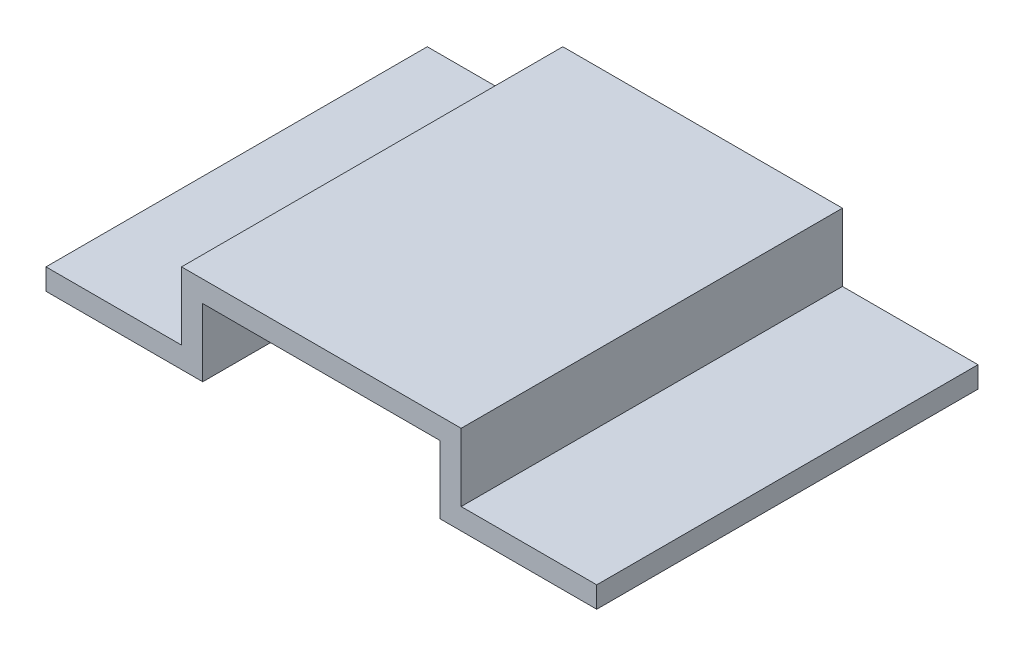
ISO-10303-21;
HEADER;
FILE_DESCRIPTION(('STEP AP214'),'2;1');
FILE_NAME('part.step','',(''),(''),'','','');
FILE_SCHEMA(('AUTOMOTIVE_DESIGN { 1 0 10303 214 1 1 1 1 }'));
ENDSEC;
DATA;
#1=APPLICATION_CONTEXT('core data for automotive mechanical design processes');
#2=APPLICATION_PROTOCOL_DEFINITION('international standard','automotive_design',2000,#1);
#3=PRODUCT_CONTEXT('',#1,'mechanical');
#4=PRODUCT('Part','Part','',(#3));
#5=PRODUCT_RELATED_PRODUCT_CATEGORY('part','',(#4));
#6=PRODUCT_DEFINITION_FORMATION('','',#4);
#7=PRODUCT_DEFINITION_CONTEXT('part definition',#1,'design');
#8=PRODUCT_DEFINITION('design','',#6,#7);
#9=PRODUCT_DEFINITION_SHAPE('','',#8);
#10=(LENGTH_UNIT() NAMED_UNIT(*) SI_UNIT(.MILLI.,.METRE.));
#11=(NAMED_UNIT(*) PLANE_ANGLE_UNIT() SI_UNIT($,.RADIAN.));
#12=(NAMED_UNIT(*) SI_UNIT($,.STERADIAN.) SOLID_ANGLE_UNIT());
#13=UNCERTAINTY_MEASURE_WITH_UNIT(LENGTH_MEASURE(1.E-05),#10,'distance_accuracy_value','');
#14=(GEOMETRIC_REPRESENTATION_CONTEXT(3) GLOBAL_UNCERTAINTY_ASSIGNED_CONTEXT((#13)) GLOBAL_UNIT_ASSIGNED_CONTEXT((#10,
#11,#12)) REPRESENTATION_CONTEXT('',''));
#15=CARTESIAN_POINT('',(0.,0.,0.));
#16=DIRECTION('',(0.,0.,1.));
#17=DIRECTION('',(1.,0.,0.));
#18=AXIS2_PLACEMENT_3D('',#15,#16,#17);
#19=CARTESIAN_POINT('',(210.,25.,450.));
#20=DIRECTION('',(-1.,0.,0.));
#21=DIRECTION('',(0.,0.,1.));
#22=AXIS2_PLACEMENT_3D('',#19,#20,#21);
#23=PLANE('',#22);
#24=DIRECTION('',(0.,1.,0.));
#25=VECTOR('',#24,1.);
#26=CARTESIAN_POINT('',(210.,25.,0.));
#27=LINE('',#26,#25);
#28=CARTESIAN_POINT('',(210.,25.,0.));
#29=VERTEX_POINT('',#28);
#30=CARTESIAN_POINT('',(210.,105.,0.));
#31=VERTEX_POINT('',#30);
#32=EDGE_CURVE('E154',#29,#31,#27,.T.);
#33=ORIENTED_EDGE('',*,*,#32,.F.);
#34=DIRECTION('',(0.,0.,-1.));
#35=VECTOR('',#34,1.);
#36=CARTESIAN_POINT('',(210.,25.,450.));
#37=LINE('',#36,#35);
#38=CARTESIAN_POINT('',(210.,25.,450.));
#39=VERTEX_POINT('',#38);
#40=EDGE_CURVE('E11',#39,#29,#37,.T.);
#41=ORIENTED_EDGE('',*,*,#40,.F.);
#42=DIRECTION('',(0.,1.,0.));
#43=VECTOR('',#42,1.);
#44=CARTESIAN_POINT('',(210.,25.,450.));
#45=LINE('',#44,#43);
#46=CARTESIAN_POINT('',(210.,105.,450.));
#47=VERTEX_POINT('',#46);
#48=EDGE_CURVE('E184',#39,#47,#45,.T.);
#49=ORIENTED_EDGE('',*,*,#48,.T.);
#50=DIRECTION('',(0.,0.,-1.));
#51=VECTOR('',#50,1.);
#52=CARTESIAN_POINT('',(210.,105.,450.));
#53=LINE('',#52,#51);
#54=EDGE_CURVE('E37',#47,#31,#53,.T.);
#55=ORIENTED_EDGE('',*,*,#54,.T.);
#56=EDGE_LOOP('',(#33,#41,#49,#55));
#57=FACE_BOUND('',#56,.T.);
#58=ADVANCED_FACE('F34',(#57),#23,.T.);
#59=CARTESIAN_POINT('',(50.,25.,450.));
#60=DIRECTION('',(0.,1.,0.));
#61=DIRECTION('',(0.,0.,1.));
#62=AXIS2_PLACEMENT_3D('',#59,#60,#61);
#63=PLANE('',#62);
#64=DIRECTION('',(1.,0.,0.));
#65=VECTOR('',#64,1.);
#66=CARTESIAN_POINT('',(50.,25.,0.));
#67=LINE('',#66,#65);
#68=CARTESIAN_POINT('',(50.,25.,0.));
#69=VERTEX_POINT('',#68);
#70=EDGE_CURVE('E182',#69,#29,#67,.T.);
#71=ORIENTED_EDGE('',*,*,#70,.F.);
#72=DIRECTION('',(0.,0.,-1.));
#73=VECTOR('',#72,1.);
#74=CARTESIAN_POINT('',(50.,25.,450.));
#75=LINE('',#74,#73);
#76=CARTESIAN_POINT('',(50.,25.,450.));
#77=VERTEX_POINT('',#76);
#78=EDGE_CURVE('E43',#77,#69,#75,.T.);
#79=ORIENTED_EDGE('',*,*,#78,.F.);
#80=DIRECTION('',(1.,0.,0.));
#81=VECTOR('',#80,1.);
#82=CARTESIAN_POINT('',(50.,25.,450.));
#83=LINE('',#82,#81);
#84=EDGE_CURVE('E134',#77,#39,#83,.T.);
#85=ORIENTED_EDGE('',*,*,#84,.T.);
#86=ORIENTED_EDGE('',*,*,#40,.T.);
#87=EDGE_LOOP('',(#71,#79,#85,#86));
#88=FACE_BOUND('',#87,.T.);
#89=ADVANCED_FACE('F207',(#88),#63,.T.);
#90=CARTESIAN_POINT('',(50.,25.,450.));
#91=DIRECTION('',(1.,0.,0.));
#92=DIRECTION('',(0.,0.,-1.));
#93=AXIS2_PLACEMENT_3D('',#90,#91,#92);
#94=PLANE('',#93);
#95=DIRECTION('',(0.,-1.,0.));
#96=VECTOR('',#95,1.);
#97=CARTESIAN_POINT('',(50.,25.,0.));
#98=LINE('',#97,#96);
#99=CARTESIAN_POINT('',(50.,0.,0.));
#100=VERTEX_POINT('',#99);
#101=EDGE_CURVE('E139',#69,#100,#98,.T.);
#102=ORIENTED_EDGE('',*,*,#101,.T.);
#103=DIRECTION('',(0.,0.,-1.));
#104=VECTOR('',#103,1.);
#105=CARTESIAN_POINT('',(50.,0.,450.));
#106=LINE('',#105,#104);
#107=CARTESIAN_POINT('',(50.,0.,450.));
#108=VERTEX_POINT('',#107);
#109=EDGE_CURVE('E137',#108,#100,#106,.T.);
#110=ORIENTED_EDGE('',*,*,#109,.F.);
#111=DIRECTION('',(0.,-1.,0.));
#112=VECTOR('',#111,1.);
#113=CARTESIAN_POINT('',(50.,25.,450.));
#114=LINE('',#113,#112);
#115=EDGE_CURVE('E128',#77,#108,#114,.T.);
#116=ORIENTED_EDGE('',*,*,#115,.F.);
#117=ORIENTED_EDGE('',*,*,#78,.T.);
#118=EDGE_LOOP('',(#102,#110,#116,#117));
#119=FACE_BOUND('',#118,.T.);
#120=ADVANCED_FACE('F138',(#119),#94,.F.);
#121=CARTESIAN_POINT('',(50.,0.,450.));
#122=DIRECTION('',(0.,1.,0.));
#123=DIRECTION('',(0.,0.,1.));
#124=AXIS2_PLACEMENT_3D('',#121,#122,#123);
#125=PLANE('',#124);
#126=DIRECTION('',(1.,0.,0.));
#127=VECTOR('',#126,1.);
#128=CARTESIAN_POINT('',(50.,0.,0.));
#129=LINE('',#128,#127);
#130=CARTESIAN_POINT('',(235.,0.,0.));
#131=VERTEX_POINT('',#130);
#132=EDGE_CURVE('E179',#100,#131,#129,.T.);
#133=ORIENTED_EDGE('',*,*,#132,.T.);
#134=DIRECTION('',(0.,0.,-1.));
#135=VECTOR('',#134,1.);
#136=CARTESIAN_POINT('',(235.,0.,450.));
#137=LINE('',#136,#135);
#138=CARTESIAN_POINT('',(235.,0.,450.));
#139=VERTEX_POINT('',#138);
#140=EDGE_CURVE('E142',#139,#131,#137,.T.);
#141=ORIENTED_EDGE('',*,*,#140,.F.);
#142=DIRECTION('',(1.,0.,0.));
#143=VECTOR('',#142,1.);
#144=CARTESIAN_POINT('',(50.,0.,450.));
#145=LINE('',#144,#143);
#146=EDGE_CURVE('E132',#108,#139,#145,.T.);
#147=ORIENTED_EDGE('',*,*,#146,.F.);
#148=ORIENTED_EDGE('',*,*,#109,.T.);
#149=EDGE_LOOP('',(#133,#141,#147,#148));
#150=FACE_BOUND('',#149,.T.);
#151=ADVANCED_FACE('F144',(#150),#125,.F.);
#152=CARTESIAN_POINT('',(235.,0.,450.));
#153=DIRECTION('',(-1.,0.,0.));
#154=DIRECTION('',(0.,0.,1.));
#155=AXIS2_PLACEMENT_3D('',#152,#153,#154);
#156=PLANE('',#155);
#157=DIRECTION('',(0.,1.,0.));
#158=VECTOR('',#157,1.);
#159=CARTESIAN_POINT('',(235.,0.,0.));
#160=LINE('',#159,#158);
#161=CARTESIAN_POINT('',(235.,80.,0.));
#162=VERTEX_POINT('',#161);
#163=EDGE_CURVE('E177',#131,#162,#160,.T.);
#164=ORIENTED_EDGE('',*,*,#163,.T.);
#165=DIRECTION('',(0.,0.,-1.));
#166=VECTOR('',#165,1.);
#167=CARTESIAN_POINT('',(235.,80.,450.));
#168=LINE('',#167,#166);
#169=CARTESIAN_POINT('',(235.,80.,450.));
#170=VERTEX_POINT('',#169);
#171=EDGE_CURVE('E188',#170,#162,#168,.T.);
#172=ORIENTED_EDGE('',*,*,#171,.F.);
#173=DIRECTION('',(0.,1.,0.));
#174=VECTOR('',#173,1.);
#175=CARTESIAN_POINT('',(235.,0.,450.));
#176=LINE('',#175,#174);
#177=EDGE_CURVE('E147',#139,#170,#176,.T.);
#178=ORIENTED_EDGE('',*,*,#177,.F.);
#179=ORIENTED_EDGE('',*,*,#140,.T.);
#180=EDGE_LOOP('',(#164,#172,#178,#179));
#181=FACE_BOUND('',#180,.T.);
#182=ADVANCED_FACE('F220',(#181),#156,.F.);
#183=CARTESIAN_POINT('',(235.,80.,450.));
#184=DIRECTION('',(0.,1.,0.));
#185=DIRECTION('',(-1.,0.,0.));
#186=AXIS2_PLACEMENT_3D('',#183,#184,#185);
#187=PLANE('',#186);
#188=DIRECTION('',(1.,0.,0.));
#189=VECTOR('',#188,1.);
#190=CARTESIAN_POINT('',(235.,80.,0.));
#191=LINE('',#190,#189);
#192=CARTESIAN_POINT('',(515.,80.,0.));
#193=VERTEX_POINT('',#192);
#194=EDGE_CURVE('E174',#162,#193,#191,.T.);
#195=ORIENTED_EDGE('',*,*,#194,.T.);
#196=DIRECTION('',(0.,0.,-1.));
#197=VECTOR('',#196,1.);
#198=CARTESIAN_POINT('',(515.,80.,450.));
#199=LINE('',#198,#197);
#200=CARTESIAN_POINT('',(515.,80.,450.));
#201=VERTEX_POINT('',#200);
#202=EDGE_CURVE('E191',#201,#193,#199,.T.);
#203=ORIENTED_EDGE('',*,*,#202,.F.);
#204=DIRECTION('',(1.,0.,0.));
#205=VECTOR('',#204,1.);
#206=CARTESIAN_POINT('',(235.,80.,450.));
#207=LINE('',#206,#205);
#208=EDGE_CURVE('E149',#170,#201,#207,.T.);
#209=ORIENTED_EDGE('',*,*,#208,.F.);
#210=ORIENTED_EDGE('',*,*,#171,.T.);
#211=EDGE_LOOP('',(#195,#203,#209,#210));
#212=FACE_BOUND('',#211,.T.);
#213=ADVANCED_FACE('F223',(#212),#187,.F.);
#214=CARTESIAN_POINT('',(515.,0.,450.));
#215=DIRECTION('',(-1.,0.,0.));
#216=DIRECTION('',(0.,0.,1.));
#217=AXIS2_PLACEMENT_3D('',#214,#215,#216);
#218=PLANE('',#217);
#219=DIRECTION('',(0.,1.,0.));
#220=VECTOR('',#219,1.);
#221=CARTESIAN_POINT('',(515.,0.,0.));
#222=LINE('',#221,#220);
#223=CARTESIAN_POINT('',(515.,0.,0.));
#224=VERTEX_POINT('',#223);
#225=EDGE_CURVE('E171',#224,#193,#222,.T.);
#226=ORIENTED_EDGE('',*,*,#225,.F.);
#227=DIRECTION('',(0.,0.,-1.));
#228=VECTOR('',#227,1.);
#229=CARTESIAN_POINT('',(515.,0.,450.));
#230=LINE('',#229,#228);
#231=CARTESIAN_POINT('',(515.,0.,450.));
#232=VERTEX_POINT('',#231);
#233=EDGE_CURVE('E193',#232,#224,#230,.T.);
#234=ORIENTED_EDGE('',*,*,#233,.F.);
#235=DIRECTION('',(0.,1.,0.));
#236=VECTOR('',#235,1.);
#237=CARTESIAN_POINT('',(515.,0.,450.));
#238=LINE('',#237,#236);
#239=EDGE_CURVE('E349',#232,#201,#238,.T.);
#240=ORIENTED_EDGE('',*,*,#239,.T.);
#241=ORIENTED_EDGE('',*,*,#202,.T.);
#242=EDGE_LOOP('',(#226,#234,#240,#241));
#243=FACE_BOUND('',#242,.T.);
#244=ADVANCED_FACE('F227',(#243),#218,.T.);
#245=CARTESIAN_POINT('',(700.,0.,450.));
#246=DIRECTION('',(0.,-1.,0.));
#247=DIRECTION('',(1.,0.,0.));
#248=AXIS2_PLACEMENT_3D('',#245,#246,#247);
#249=PLANE('',#248);
#250=DIRECTION('',(-1.,0.,0.));
#251=VECTOR('',#250,1.);
#252=CARTESIAN_POINT('',(700.,0.,0.));
#253=LINE('',#252,#251);
#254=CARTESIAN_POINT('',(700.,0.,0.));
#255=VERTEX_POINT('',#254);
#256=EDGE_CURVE('E168',#255,#224,#253,.T.);
#257=ORIENTED_EDGE('',*,*,#256,.F.);
#258=DIRECTION('',(0.,0.,-1.));
#259=VECTOR('',#258,1.);
#260=CARTESIAN_POINT('',(700.,0.,450.));
#261=LINE('',#260,#259);
#262=CARTESIAN_POINT('',(700.,0.,450.));
#263=VERTEX_POINT('',#262);
#264=EDGE_CURVE('E195',#263,#255,#261,.T.);
#265=ORIENTED_EDGE('',*,*,#264,.F.);
#266=DIRECTION('',(-1.,0.,0.));
#267=VECTOR('',#266,1.);
#268=CARTESIAN_POINT('',(700.,0.,450.));
#269=LINE('',#268,#267);
#270=EDGE_CURVE('E352',#263,#232,#269,.T.);
#271=ORIENTED_EDGE('',*,*,#270,.T.);
#272=ORIENTED_EDGE('',*,*,#233,.T.);
#273=EDGE_LOOP('',(#257,#265,#271,#272));
#274=FACE_BOUND('',#273,.T.);
#275=ADVANCED_FACE('F231',(#274),#249,.T.);
#276=CARTESIAN_POINT('',(700.,25.0000000000001,450.));
#277=DIRECTION('',(1.,0.,0.));
#278=DIRECTION('',(0.,0.,-1.));
#279=AXIS2_PLACEMENT_3D('',#276,#277,#278);
#280=PLANE('',#279);
#281=DIRECTION('',(0.,-1.,0.));
#282=VECTOR('',#281,1.);
#283=CARTESIAN_POINT('',(700.,25.0000000000001,0.));
#284=LINE('',#283,#282);
#285=CARTESIAN_POINT('',(700.,25.0000000000001,0.));
#286=VERTEX_POINT('',#285);
#287=EDGE_CURVE('E165',#286,#255,#284,.T.);
#288=ORIENTED_EDGE('',*,*,#287,.F.);
#289=DIRECTION('',(0.,0.,-1.));
#290=VECTOR('',#289,1.);
#291=CARTESIAN_POINT('',(700.,25.0000000000001,450.));
#292=LINE('',#291,#290);
#293=CARTESIAN_POINT('',(700.,25.0000000000001,450.));
#294=VERTEX_POINT('',#293);
#295=EDGE_CURVE('E197',#294,#286,#292,.T.);
#296=ORIENTED_EDGE('',*,*,#295,.F.);
#297=DIRECTION('',(0.,-1.,0.));
#298=VECTOR('',#297,1.);
#299=CARTESIAN_POINT('',(700.,25.0000000000001,450.));
#300=LINE('',#299,#298);
#301=EDGE_CURVE('E340',#294,#263,#300,.T.);
#302=ORIENTED_EDGE('',*,*,#301,.T.);
#303=ORIENTED_EDGE('',*,*,#264,.T.);
#304=EDGE_LOOP('',(#288,#296,#302,#303));
#305=FACE_BOUND('',#304,.T.);
#306=ADVANCED_FACE('F235',(#305),#280,.T.);
#307=CARTESIAN_POINT('',(700.,25.0000000000001,450.));
#308=DIRECTION('',(0.,-1.,0.));
#309=DIRECTION('',(1.,0.,0.));
#310=AXIS2_PLACEMENT_3D('',#307,#308,#309);
#311=PLANE('',#310);
#312=DIRECTION('',(-1.,0.,0.));
#313=VECTOR('',#312,1.);
#314=CARTESIAN_POINT('',(700.,25.0000000000001,0.));
#315=LINE('',#314,#313);
#316=CARTESIAN_POINT('',(540.,25.,0.));
#317=VERTEX_POINT('',#316);
#318=EDGE_CURVE('E163',#286,#317,#315,.T.);
#319=ORIENTED_EDGE('',*,*,#318,.T.);
#320=DIRECTION('',(0.,0.,-1.));
#321=VECTOR('',#320,1.);
#322=CARTESIAN_POINT('',(540.,25.,450.));
#323=LINE('',#322,#321);
#324=CARTESIAN_POINT('',(540.,25.,450.));
#325=VERTEX_POINT('',#324);
#326=EDGE_CURVE('E199',#325,#317,#323,.T.);
#327=ORIENTED_EDGE('',*,*,#326,.F.);
#328=DIRECTION('',(-1.,0.,0.));
#329=VECTOR('',#328,1.);
#330=CARTESIAN_POINT('',(700.,25.0000000000001,450.));
#331=LINE('',#330,#329);
#332=EDGE_CURVE('E357',#294,#325,#331,.T.);
#333=ORIENTED_EDGE('',*,*,#332,.F.);
#334=ORIENTED_EDGE('',*,*,#295,.T.);
#335=EDGE_LOOP('',(#319,#327,#333,#334));
#336=FACE_BOUND('',#335,.T.);
#337=ADVANCED_FACE('F239',(#336),#311,.F.);
#338=CARTESIAN_POINT('',(540.,25.,450.));
#339=DIRECTION('',(-1.,0.,0.));
#340=DIRECTION('',(0.,0.,1.));
#341=AXIS2_PLACEMENT_3D('',#338,#339,#340);
#342=PLANE('',#341);
#343=DIRECTION('',(0.,1.,0.));
#344=VECTOR('',#343,1.);
#345=CARTESIAN_POINT('',(540.,25.,0.));
#346=LINE('',#345,#344);
#347=CARTESIAN_POINT('',(540.,105.,0.));
#348=VERTEX_POINT('',#347);
#349=EDGE_CURVE('E160',#317,#348,#346,.T.);
#350=ORIENTED_EDGE('',*,*,#349,.T.);
#351=DIRECTION('',(0.,0.,-1.));
#352=VECTOR('',#351,1.);
#353=CARTESIAN_POINT('',(540.,105.,450.));
#354=LINE('',#353,#352);
#355=CARTESIAN_POINT('',(540.,105.,450.));
#356=VERTEX_POINT('',#355);
#357=EDGE_CURVE('E201',#356,#348,#354,.T.);
#358=ORIENTED_EDGE('',*,*,#357,.F.);
#359=DIRECTION('',(0.,1.,0.));
#360=VECTOR('',#359,1.);
#361=CARTESIAN_POINT('',(540.,25.,450.));
#362=LINE('',#361,#360);
#363=EDGE_CURVE('E359',#325,#356,#362,.T.);
#364=ORIENTED_EDGE('',*,*,#363,.F.);
#365=ORIENTED_EDGE('',*,*,#326,.T.);
#366=EDGE_LOOP('',(#350,#358,#364,#365));
#367=FACE_BOUND('',#366,.T.);
#368=ADVANCED_FACE('F243',(#367),#342,.F.);
#369=CARTESIAN_POINT('',(210.,105.,450.));
#370=DIRECTION('',(0.,1.,0.));
#371=DIRECTION('',(-1.,0.,0.));
#372=AXIS2_PLACEMENT_3D('',#369,#370,#371);
#373=PLANE('',#372);
#374=DIRECTION('',(1.,0.,0.));
#375=VECTOR('',#374,1.);
#376=CARTESIAN_POINT('',(210.,105.,0.));
#377=LINE('',#376,#375);
#378=EDGE_CURVE('E157',#31,#348,#377,.T.);
#379=ORIENTED_EDGE('',*,*,#378,.F.);
#380=ORIENTED_EDGE('',*,*,#54,.F.);
#381=DIRECTION('',(1.,0.,0.));
#382=VECTOR('',#381,1.);
#383=CARTESIAN_POINT('',(210.,105.,450.));
#384=LINE('',#383,#382);
#385=EDGE_CURVE('E361',#47,#356,#384,.T.);
#386=ORIENTED_EDGE('',*,*,#385,.T.);
#387=ORIENTED_EDGE('',*,*,#357,.T.);
#388=EDGE_LOOP('',(#379,#380,#386,#387));
#389=FACE_BOUND('',#388,.T.);
#390=ADVANCED_FACE('F203',(#389),#373,.T.);
#391=CARTESIAN_POINT('',(0.,0.,450.));
#392=DIRECTION('',(0.,0.,-1.));
#393=DIRECTION('',(-1.,0.,0.));
#394=AXIS2_PLACEMENT_3D('',#391,#392,#393);
#395=PLANE('',#394);
#396=ORIENTED_EDGE('',*,*,#48,.F.);
#397=ORIENTED_EDGE('',*,*,#84,.F.);
#398=ORIENTED_EDGE('',*,*,#115,.T.);
#399=ORIENTED_EDGE('',*,*,#146,.T.);
#400=ORIENTED_EDGE('',*,*,#177,.T.);
#401=ORIENTED_EDGE('',*,*,#208,.T.);
#402=ORIENTED_EDGE('',*,*,#239,.F.);
#403=ORIENTED_EDGE('',*,*,#270,.F.);
#404=ORIENTED_EDGE('',*,*,#301,.F.);
#405=ORIENTED_EDGE('',*,*,#332,.T.);
#406=ORIENTED_EDGE('',*,*,#363,.T.);
#407=ORIENTED_EDGE('',*,*,#385,.F.);
#408=EDGE_LOOP('',(#396,#397,#398,#399,#400,#401,#402,#403,#404,#405,#406,#407));
#409=FACE_BOUND('',#408,.T.);
#410=ADVANCED_FACE('F130',(#409),#395,.F.);
#411=CARTESIAN_POINT('',(0.,0.,0.));
#412=DIRECTION('',(0.,0.,-1.));
#413=DIRECTION('',(-1.,0.,0.));
#414=AXIS2_PLACEMENT_3D('',#411,#412,#413);
#415=PLANE('',#414);
#416=ORIENTED_EDGE('',*,*,#32,.T.);
#417=ORIENTED_EDGE('',*,*,#378,.T.);
#418=ORIENTED_EDGE('',*,*,#349,.F.);
#419=ORIENTED_EDGE('',*,*,#318,.F.);
#420=ORIENTED_EDGE('',*,*,#287,.T.);
#421=ORIENTED_EDGE('',*,*,#256,.T.);
#422=ORIENTED_EDGE('',*,*,#225,.T.);
#423=ORIENTED_EDGE('',*,*,#194,.F.);
#424=ORIENTED_EDGE('',*,*,#163,.F.);
#425=ORIENTED_EDGE('',*,*,#132,.F.);
#426=ORIENTED_EDGE('',*,*,#101,.F.);
#427=ORIENTED_EDGE('',*,*,#70,.T.);
#428=EDGE_LOOP('',(#416,#417,#418,#419,#420,#421,#422,#423,#424,#425,#426,#427));
#429=FACE_BOUND('',#428,.T.);
#430=ADVANCED_FACE('F206',(#429),#415,.T.);
#431=CLOSED_SHELL('',(#58,#89,#120,#151,#182,#213,#244,#275,#306,#337,#368,#390,#410,#430));
#432=MANIFOLD_SOLID_BREP('B2',#431);
#433=ADVANCED_BREP_SHAPE_REPRESENTATION('',(#18,#432),#14);
#434=SHAPE_DEFINITION_REPRESENTATION(#9,#433);
ENDSEC;
END-ISO-10303-21;
